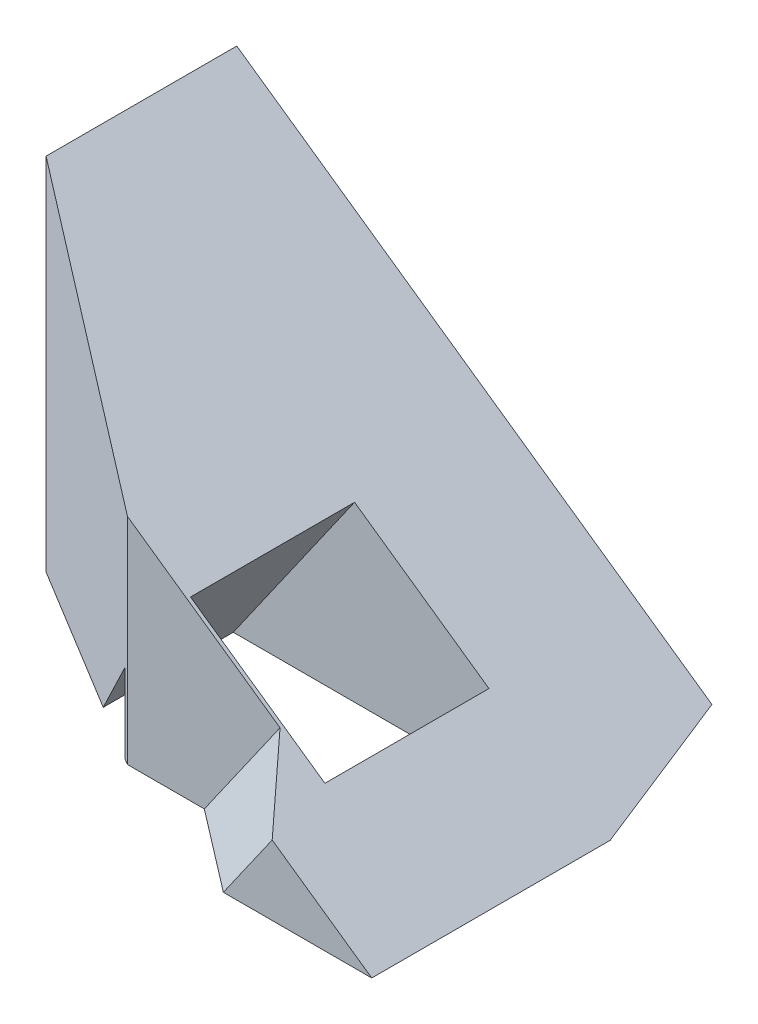
ISO-10303-21;
HEADER;
FILE_DESCRIPTION(('STEP AP214'),'2;1');
FILE_NAME('part.step','',(''),(''),'','','');
FILE_SCHEMA(('AUTOMOTIVE_DESIGN { 1 0 10303 214 1 1 1 1 }'));
ENDSEC;
DATA;
#1=APPLICATION_CONTEXT('core data for automotive mechanical design processes');
#2=APPLICATION_PROTOCOL_DEFINITION('international standard','automotive_design',2000,#1);
#3=PRODUCT_CONTEXT('',#1,'mechanical');
#4=PRODUCT('Part','Part','',(#3));
#5=PRODUCT_RELATED_PRODUCT_CATEGORY('part','',(#4));
#6=PRODUCT_DEFINITION_FORMATION('','',#4);
#7=PRODUCT_DEFINITION_CONTEXT('part definition',#1,'design');
#8=PRODUCT_DEFINITION('design','',#6,#7);
#9=PRODUCT_DEFINITION_SHAPE('','',#8);
#10=(LENGTH_UNIT() NAMED_UNIT(*) SI_UNIT(.MILLI.,.METRE.));
#11=(NAMED_UNIT(*) PLANE_ANGLE_UNIT() SI_UNIT($,.RADIAN.));
#12=(NAMED_UNIT(*) SI_UNIT($,.STERADIAN.) SOLID_ANGLE_UNIT());
#13=UNCERTAINTY_MEASURE_WITH_UNIT(LENGTH_MEASURE(1.E-05),#10,'distance_accuracy_value','');
#14=(GEOMETRIC_REPRESENTATION_CONTEXT(3) GLOBAL_UNCERTAINTY_ASSIGNED_CONTEXT((#13)) GLOBAL_UNIT_ASSIGNED_CONTEXT((#10,
#11,#12)) REPRESENTATION_CONTEXT('',''));
#15=CARTESIAN_POINT('',(0.,0.,0.));
#16=DIRECTION('',(0.,0.,1.));
#17=DIRECTION('',(1.,0.,0.));
#18=AXIS2_PLACEMENT_3D('',#15,#16,#17);
#19=CARTESIAN_POINT('',(0.,0.,0.));
#20=DIRECTION('',(0.,-1.,0.));
#21=DIRECTION('',(0.,0.,-1.));
#22=AXIS2_PLACEMENT_3D('',#19,#20,#21);
#23=PLANE('',#22);
#24=DIRECTION('',(-1.,0.,0.));
#25=VECTOR('',#24,1.);
#26=CARTESIAN_POINT('',(0.,0.,-42.446196436293));
#27=LINE('',#26,#25);
#28=CARTESIAN_POINT('',(83.1695964602295,0.,-42.446196436293));
#29=VERTEX_POINT('',#28);
#30=CARTESIAN_POINT('',(77.5443267417553,0.,-42.446196436293));
#31=VERTEX_POINT('',#30);
#32=EDGE_CURVE('E143',#29,#31,#27,.T.);
#33=ORIENTED_EDGE('',*,*,#32,.T.);
#34=DIRECTION('',(-0.854581285290634,0.,-0.519317655034957));
#35=VECTOR('',#34,1.);
#36=CARTESIAN_POINT('',(62.3754676428153,0.,-51.6641099015267));
#37=LINE('',#36,#35);
#38=CARTESIAN_POINT('',(77.1329305197103,0.,-42.696196436293));
#39=VERTEX_POINT('',#38);
#40=EDGE_CURVE('E128',#31,#39,#37,.T.);
#41=ORIENTED_EDGE('',*,*,#40,.T.);
#42=DIRECTION('',(-1.,0.,0.));
#43=VECTOR('',#42,1.);
#44=CARTESIAN_POINT('',(0.,0.,-42.696196436293));
#45=LINE('',#44,#43);
#46=CARTESIAN_POINT('',(87.6864624386468,0.,-42.696196436293));
#47=VERTEX_POINT('',#46);
#48=EDGE_CURVE('E185',#47,#39,#45,.T.);
#49=ORIENTED_EDGE('',*,*,#48,.F.);
#50=DIRECTION('',(0.,0.,1.));
#51=VECTOR('',#50,1.);
#52=CARTESIAN_POINT('',(87.6864624386468,0.,0.));
#53=LINE('',#52,#51);
#54=CARTESIAN_POINT('',(87.6864624386468,0.,-54.696196436293));
#55=VERTEX_POINT('',#54);
#56=EDGE_CURVE('E191',#55,#47,#53,.T.);
#57=ORIENTED_EDGE('',*,*,#56,.F.);
#58=DIRECTION('',(1.,0.,0.));
#59=VECTOR('',#58,1.);
#60=CARTESIAN_POINT('',(0.,0.,-54.696196436293));
#61=LINE('',#60,#59);
#62=CARTESIAN_POINT('',(73.0371673735094,0.,-54.696196436293));
#63=VERTEX_POINT('',#62);
#64=EDGE_CURVE('E193',#63,#55,#61,.T.);
#65=ORIENTED_EDGE('',*,*,#64,.F.);
#66=DIRECTION('',(0.,0.,-1.));
#67=VECTOR('',#66,1.);
#68=CARTESIAN_POINT('',(73.0371673735094,0.,0.));
#69=LINE('',#68,#67);
#70=CARTESIAN_POINT('',(73.0371673735094,0.,-45.1851371014753));
#71=VERTEX_POINT('',#70);
#72=EDGE_CURVE('E195',#71,#63,#69,.T.);
#73=ORIENTED_EDGE('',*,*,#72,.F.);
#74=CARTESIAN_POINT('',(62.3754676428153,0.,-51.6641099015267));
#75=VERTEX_POINT('',#74);
#76=EDGE_CURVE('E139',#71,#75,#37,.T.);
#77=ORIENTED_EDGE('',*,*,#76,.T.);
#78=DIRECTION('',(0.,0.,-1.));
#79=VECTOR('',#78,1.);
#80=CARTESIAN_POINT('',(62.3754676428153,0.,-99.8905370971883));
#81=LINE('',#80,#79);
#82=CARTESIAN_POINT('',(62.3754676428153,0.,-65.6148234256193));
#83=VERTEX_POINT('',#82);
#84=EDGE_CURVE('E138',#75,#83,#81,.T.);
#85=ORIENTED_EDGE('',*,*,#84,.T.);
#86=DIRECTION('',(1.,0.,0.));
#87=VECTOR('',#86,1.);
#88=CARTESIAN_POINT('',(0.,0.,-65.6148234256193));
#89=LINE('',#88,#87);
#90=CARTESIAN_POINT('',(95.7185966682437,0.,-65.6148234256193));
#91=VERTEX_POINT('',#90);
#92=EDGE_CURVE('E153',#83,#91,#89,.T.);
#93=ORIENTED_EDGE('',*,*,#92,.T.);
#94=DIRECTION('',(0.383369983891683,0.,0.92359485460395));
#95=VECTOR('',#94,1.);
#96=CARTESIAN_POINT('',(104.883392133507,0.,-43.535478951937));
#97=LINE('',#96,#95);
#98=CARTESIAN_POINT('',(100.,0.,-55.3002911099867));
#99=VERTEX_POINT('',#98);
#100=EDGE_CURVE('E157',#91,#99,#97,.T.);
#101=ORIENTED_EDGE('',*,*,#100,.T.);
#102=DIRECTION('',(0.,0.,-1.));
#103=VECTOR('',#102,1.);
#104=CARTESIAN_POINT('',(100.,0.,0.));
#105=LINE('',#104,#103);
#106=CARTESIAN_POINT('',(100.,0.,-37.8598786092113));
#107=VERTEX_POINT('',#106);
#108=EDGE_CURVE('E46',#107,#99,#105,.T.);
#109=ORIENTED_EDGE('',*,*,#108,.F.);
#110=DIRECTION('',(-1.,0.,0.));
#111=VECTOR('',#110,1.);
#112=CARTESIAN_POINT('',(0.,0.,-37.8598786092113));
#113=LINE('',#112,#111);
#114=CARTESIAN_POINT('',(89.1479769112529,0.,-37.8598786092112));
#115=VERTEX_POINT('',#114);
#116=EDGE_CURVE('E155',#107,#115,#113,.T.);
#117=ORIENTED_EDGE('',*,*,#116,.T.);
#118=DIRECTION('',(-0.79342094671779,0.,-0.608673312466914));
#119=VECTOR('',#118,1.);
#120=CARTESIAN_POINT('',(51.3116563919041,0.,-66.8860325535227));
#121=LINE('',#120,#119);
#122=EDGE_CURVE('E152',#115,#29,#121,.T.);
#123=ORIENTED_EDGE('',*,*,#122,.T.);
#124=EDGE_LOOP('',(#33,#41,#49,#57,#65,#73,#77,#85,#93,#101,#109,#117,#123));
#125=FACE_BOUND('',#124,.T.);
#126=ADVANCED_FACE('F39',(#125),#23,.T.);
#127=CARTESIAN_POINT('',(49.0086749133494,-34.3162436119959,-42.696196436293));
#128=DIRECTION('',(-0.819152044288995,0.573576436351041,0.));
#129=DIRECTION('',(-0.573576436351041,-0.819152044288995,0.));
#130=AXIS2_PLACEMENT_3D('',#127,#128,#129);
#131=PLANE('',#130);
#132=DIRECTION('',(0.541618534743351,0.773511430808311,0.329134363492092));
#133=VECTOR('',#132,1.);
#134=CARTESIAN_POINT('',(52.0553594707429,-29.9651271341823,-57.9355020650059));
#135=LINE('',#134,#133);
#136=CARTESIAN_POINT('',(77.1329305197103,5.84935597333473,-42.696196436293));
#137=VERTEX_POINT('',#136);
#138=EDGE_CURVE('E253',#71,#137,#135,.T.);
#139=ORIENTED_EDGE('',*,*,#138,.F.);
#140=ORIENTED_EDGE('',*,*,#72,.T.);
#141=DIRECTION('',(0.573576436351041,0.819152044288995,0.));
#142=VECTOR('',#141,1.);
#143=CARTESIAN_POINT('',(49.0086749133494,-34.3162436119959,-54.696196436293));
#144=LINE('',#143,#142);
#145=CARTESIAN_POINT('',(81.9076677470654,12.6683874272993,-54.696196436293));
#146=VERTEX_POINT('',#145);
#147=EDGE_CURVE('E183',#63,#146,#144,.T.);
#148=ORIENTED_EDGE('',*,*,#147,.T.);
#149=DIRECTION('',(0.,0.,1.));
#150=VECTOR('',#149,1.);
#151=CARTESIAN_POINT('',(81.9076677470654,12.6683874272993,-42.696196436293));
#152=LINE('',#151,#150);
#153=CARTESIAN_POINT('',(81.9076677470654,12.6683874272993,-42.696196436293));
#154=VERTEX_POINT('',#153);
#155=EDGE_CURVE('E162',#146,#154,#152,.T.);
#156=ORIENTED_EDGE('',*,*,#155,.T.);
#157=DIRECTION('',(0.573576436351041,0.819152044288995,0.));
#158=VECTOR('',#157,1.);
#159=CARTESIAN_POINT('',(49.0086749133494,-34.3162436119959,-42.696196436293));
#160=LINE('',#159,#158);
#161=EDGE_CURVE('E180',#137,#154,#160,.T.);
#162=ORIENTED_EDGE('',*,*,#161,.F.);
#163=EDGE_LOOP('',(#139,#140,#148,#156,#162));
#164=FACE_BOUND('',#163,.T.);
#165=ADVANCED_FACE('F280',(#164),#131,.F.);
#166=CARTESIAN_POINT('',(49.0086749133494,-34.3162436119959,-42.696196436293));
#167=DIRECTION('',(0.,0.,1.));
#168=DIRECTION('',(1.,0.,0.));
#169=AXIS2_PLACEMENT_3D('',#166,#167,#168);
#170=PLANE('',#169);
#171=DIRECTION('',(0.,-1.,0.));
#172=VECTOR('',#171,1.);
#173=CARTESIAN_POINT('',(77.1329305197103,-34.3162436119959,-42.696196436293));
#174=LINE('',#173,#172);
#175=EDGE_CURVE('E134',#137,#39,#174,.T.);
#176=ORIENTED_EDGE('',*,*,#175,.F.);
#177=ORIENTED_EDGE('',*,*,#161,.T.);
#178=DIRECTION('',(0.819152044288995,-0.573576436351041,0.));
#179=VECTOR('',#178,1.);
#180=CARTESIAN_POINT('',(81.9076677470654,12.6683874272993,-42.696196436293));
#181=LINE('',#180,#179);
#182=CARTESIAN_POINT('',(91.7374922785333,5.78547019108683,-42.696196436293));
#183=VERTEX_POINT('',#182);
#184=EDGE_CURVE('E167',#154,#183,#181,.T.);
#185=ORIENTED_EDGE('',*,*,#184,.T.);
#186=DIRECTION('',(0.573576436351041,0.819152044288995,0.));
#187=VECTOR('',#186,1.);
#188=CARTESIAN_POINT('',(58.8384994448173,-41.1991608482084,-42.696196436293));
#189=LINE('',#188,#187);
#190=EDGE_CURVE('E60',#47,#183,#189,.T.);
#191=ORIENTED_EDGE('',*,*,#190,.F.);
#192=ORIENTED_EDGE('',*,*,#48,.T.);
#193=EDGE_LOOP('',(#176,#177,#185,#191,#192));
#194=FACE_BOUND('',#193,.T.);
#195=ADVANCED_FACE('F285',(#194),#170,.F.);
#196=CARTESIAN_POINT('',(44.6453339080393,-31.2609993482983,-42.446196436293));
#197=DIRECTION('',(0.,0.,1.));
#198=DIRECTION('',(1.,0.,0.));
#199=AXIS2_PLACEMENT_3D('',#196,#197,#198);
#200=PLANE('',#199);
#201=DIRECTION('',(0.819152044288995,-0.573576436351041,0.));
#202=VECTOR('',#201,1.);
#203=CARTESIAN_POINT('',(77.5443267417553,15.7236316909969,-42.446196436293));
#204=LINE('',#203,#202);
#205=CARTESIAN_POINT('',(77.5443267417553,15.7236316909969,-42.446196436293));
#206=VERTEX_POINT('',#205);
#207=CARTESIAN_POINT('',(88.7066297146641,7.90770300558568,-42.446196436293));
#208=VERTEX_POINT('',#207);
#209=EDGE_CURVE('E146',#206,#208,#204,.T.);
#210=ORIENTED_EDGE('',*,*,#209,.F.);
#211=DIRECTION('',(0.,-1.,0.));
#212=VECTOR('',#211,1.);
#213=CARTESIAN_POINT('',(77.5443267417553,50.,-42.446196436293));
#214=LINE('',#213,#212);
#215=EDGE_CURVE('E131',#206,#31,#214,.T.);
#216=ORIENTED_EDGE('',*,*,#215,.T.);
#217=ORIENTED_EDGE('',*,*,#32,.F.);
#218=DIRECTION('',(0.573576436351041,0.819152044288995,0.));
#219=VECTOR('',#218,1.);
#220=CARTESIAN_POINT('',(55.807636880948,-39.0769280337095,-42.446196436293));
#221=LINE('',#220,#219);
#222=EDGE_CURVE('E237',#29,#208,#221,.T.);
#223=ORIENTED_EDGE('',*,*,#222,.T.);
#224=EDGE_LOOP('',(#210,#216,#217,#223));
#225=FACE_BOUND('',#224,.T.);
#226=ADVANCED_FACE('F142',(#225),#200,.T.);
#227=CARTESIAN_POINT('',(64.2281424098247,-44.9730294805654,-65.6148234256193));
#228=DIRECTION('',(0.,0.,-1.));
#229=DIRECTION('',(-1.,0.,0.));
#230=AXIS2_PLACEMENT_3D('',#227,#228,#229);
#231=PLANE('',#230);
#232=ORIENTED_EDGE('',*,*,#92,.F.);
#233=DIRECTION('',(0.,1.,0.));
#234=VECTOR('',#233,1.);
#235=CARTESIAN_POINT('',(62.3754676428153,-44.9730294805654,-65.6148234256193));
#236=LINE('',#235,#234);
#237=CARTESIAN_POINT('',(62.3754676428153,26.3449811781156,-65.6148234256193));
#238=VERTEX_POINT('',#237);
#239=EDGE_CURVE('E13',#83,#238,#236,.T.);
#240=ORIENTED_EDGE('',*,*,#239,.T.);
#241=DIRECTION('',(-0.819152044288995,0.573576436351041,0.));
#242=VECTOR('',#241,1.);
#243=CARTESIAN_POINT('',(97.1271352435407,2.01160155872979,-65.6148234256193));
#244=LINE('',#243,#242);
#245=CARTESIAN_POINT('',(97.1271352435407,2.01160155872981,-65.6148234256193));
#246=VERTEX_POINT('',#245);
#247=EDGE_CURVE('E52',#246,#238,#244,.T.);
#248=ORIENTED_EDGE('',*,*,#247,.F.);
#249=DIRECTION('',(0.573576436351041,0.819152044288995,0.));
#250=VECTOR('',#249,1.);
#251=CARTESIAN_POINT('',(64.2281424098247,-44.9730294805654,-65.6148234256193));
#252=LINE('',#251,#250);
#253=EDGE_CURVE('E234',#91,#246,#252,.T.);
#254=ORIENTED_EDGE('',*,*,#253,.F.);
#255=EDGE_LOOP('',(#232,#240,#248,#254));
#256=FACE_BOUND('',#255,.T.);
#257=ADVANCED_FACE('F263',(#256),#231,.T.);
#258=CARTESIAN_POINT('',(0.,70.0207538209701,-100.));
#259=DIRECTION('',(0.573576436351041,0.819152044288995,0.));
#260=DIRECTION('',(-0.819152044288995,0.573576436351041,0.));
#261=AXIS2_PLACEMENT_3D('',#258,#259,#260);
#262=PLANE('',#261);
#263=ORIENTED_EDGE('',*,*,#155,.F.);
#264=DIRECTION('',(-0.819152044288995,0.573576436351041,0.));
#265=VECTOR('',#264,1.);
#266=CARTESIAN_POINT('',(81.9076677470654,12.6683874272993,-54.696196436293));
#267=LINE('',#266,#265);
#268=CARTESIAN_POINT('',(91.7374922785333,5.78547019108683,-54.696196436293));
#269=VERTEX_POINT('',#268);
#270=EDGE_CURVE('E175',#269,#146,#267,.T.);
#271=ORIENTED_EDGE('',*,*,#270,.F.);
#272=DIRECTION('',(0.,0.,-1.));
#273=VECTOR('',#272,1.);
#274=CARTESIAN_POINT('',(91.7374922785333,5.78547019108683,-42.696196436293));
#275=LINE('',#274,#273);
#276=EDGE_CURVE('E181',#183,#269,#275,.T.);
#277=ORIENTED_EDGE('',*,*,#276,.F.);
#278=ORIENTED_EDGE('',*,*,#184,.F.);
#279=EDGE_LOOP('',(#263,#271,#277,#278));
#280=FACE_BOUND('',#279,.T.);
#281=DIRECTION('',(0.597894798593125,-0.418650445031278,0.683559518030727));
#282=VECTOR('',#281,1.);
#283=CARTESIAN_POINT('',(88.7066297146641,7.90770300558568,-42.446196436293));
#284=LINE('',#283,#282);
#285=CARTESIAN_POINT('',(92.718183209533,5.09878300854696,-37.8598786092113));
#286=VERTEX_POINT('',#285);
#287=EDGE_CURVE('E229',#208,#286,#284,.T.);
#288=ORIENTED_EDGE('',*,*,#287,.T.);
#289=DIRECTION('',(0.819152044288995,-0.573576436351041,0.));
#290=VECTOR('',#289,1.);
#291=CARTESIAN_POINT('',(92.718183209533,5.09878300854696,-37.8598786092113));
#292=LINE('',#291,#290);
#293=EDGE_CURVE('E212',#286,#107,#292,.T.);
#294=ORIENTED_EDGE('',*,*,#293,.T.);
#295=ORIENTED_EDGE('',*,*,#108,.T.);
#296=DIRECTION('',(-0.263699366796137,0.18464428445178,-0.946767728733192));
#297=VECTOR('',#296,1.);
#298=CARTESIAN_POINT('',(100.,0.,-55.3002911099867));
#299=LINE('',#298,#297);
#300=EDGE_CURVE('E208',#99,#246,#299,.T.);
#301=ORIENTED_EDGE('',*,*,#300,.T.);
#302=ORIENTED_EDGE('',*,*,#247,.T.);
#303=DIRECTION('',(0.,0.,1.));
#304=VECTOR('',#303,1.);
#305=CARTESIAN_POINT('',(62.3754676428153,26.3449811781156,-65.6148234256193));
#306=LINE('',#305,#304);
#307=CARTESIAN_POINT('',(62.3754676428153,26.3449811781156,-51.6641099015267));
#308=VERTEX_POINT('',#307);
#309=EDGE_CURVE('E218',#238,#308,#306,.T.);
#310=ORIENTED_EDGE('',*,*,#309,.T.);
#311=DIRECTION('',(0.733319618982665,-0.513475925128728,0.445628556903971));
#312=VECTOR('',#311,1.);
#313=CARTESIAN_POINT('',(62.3754676428153,26.3449811781156,-51.6641099015267));
#314=LINE('',#313,#312);
#315=EDGE_CURVE('E223',#308,#206,#314,.T.);
#316=ORIENTED_EDGE('',*,*,#315,.T.);
#317=ORIENTED_EDGE('',*,*,#209,.T.);
#318=EDGE_LOOP('',(#288,#294,#295,#301,#302,#310,#316,#317));
#319=FACE_BOUND('',#318,.T.);
#320=ADVANCED_FACE('F247',(#280,#319),#262,.T.);
#321=CARTESIAN_POINT('',(49.0086749133494,-34.3162436119959,-54.696196436293));
#322=DIRECTION('',(0.,0.,-1.));
#323=DIRECTION('',(-1.,0.,0.));
#324=AXIS2_PLACEMENT_3D('',#321,#322,#323);
#325=PLANE('',#324);
#326=ORIENTED_EDGE('',*,*,#64,.T.);
#327=DIRECTION('',(0.573576436351041,0.819152044288995,0.));
#328=VECTOR('',#327,1.);
#329=CARTESIAN_POINT('',(58.8384994448173,-41.1991608482084,-54.696196436293));
#330=LINE('',#329,#328);
#331=EDGE_CURVE('E186',#55,#269,#330,.T.);
#332=ORIENTED_EDGE('',*,*,#331,.T.);
#333=ORIENTED_EDGE('',*,*,#270,.T.);
#334=ORIENTED_EDGE('',*,*,#147,.F.);
#335=EDGE_LOOP('',(#326,#332,#333,#334));
#336=FACE_BOUND('',#335,.T.);
#337=ADVANCED_FACE('F293',(#336),#325,.F.);
#338=CARTESIAN_POINT('',(58.8384994448173,-41.1991608482084,-42.696196436293));
#339=DIRECTION('',(0.819152044288995,-0.573576436351041,0.));
#340=DIRECTION('',(0.573576436351041,0.819152044288995,0.));
#341=AXIS2_PLACEMENT_3D('',#338,#339,#340);
#342=PLANE('',#341);
#343=ORIENTED_EDGE('',*,*,#56,.T.);
#344=ORIENTED_EDGE('',*,*,#190,.T.);
#345=ORIENTED_EDGE('',*,*,#276,.T.);
#346=ORIENTED_EDGE('',*,*,#331,.F.);
#347=EDGE_LOOP('',(#343,#344,#345,#346));
#348=FACE_BOUND('',#347,.T.);
#349=ADVANCED_FACE('F300',(#348),#342,.F.);
#350=CARTESIAN_POINT('',(59.819190375817,-41.8858480307483,-37.8598786092113));
#351=DIRECTION('',(0.,0.,1.));
#352=DIRECTION('',(1.,0.,0.));
#353=AXIS2_PLACEMENT_3D('',#350,#351,#352);
#354=PLANE('',#353);
#355=ORIENTED_EDGE('',*,*,#293,.F.);
#356=DIRECTION('',(0.573576436351041,0.819152044288995,0.));
#357=VECTOR('',#356,1.);
#358=CARTESIAN_POINT('',(59.819190375817,-41.8858480307483,-37.8598786092113));
#359=LINE('',#358,#357);
#360=EDGE_CURVE('E235',#115,#286,#359,.T.);
#361=ORIENTED_EDGE('',*,*,#360,.F.);
#362=ORIENTED_EDGE('',*,*,#116,.F.);
#363=EDGE_LOOP('',(#355,#361,#362));
#364=FACE_BOUND('',#363,.T.);
#365=ADVANCED_FACE('F274',(#364),#354,.T.);
#366=CARTESIAN_POINT('',(55.807636880948,-39.0769280337095,-42.446196436293));
#367=DIRECTION('',(-0.55993917658807,0.3920736323859,0.729894776875133));
#368=DIRECTION('',(0.79342094671779,0.,0.608673312466914));
#369=AXIS2_PLACEMENT_3D('',#366,#367,#368);
#370=PLANE('',#369);
#371=ORIENTED_EDGE('',*,*,#360,.T.);
#372=ORIENTED_EDGE('',*,*,#287,.F.);
#373=ORIENTED_EDGE('',*,*,#222,.F.);
#374=ORIENTED_EDGE('',*,*,#122,.F.);
#375=EDGE_LOOP('',(#371,#372,#373,#374));
#376=FACE_BOUND('',#375,.T.);
#377=ADVANCED_FACE('F266',(#376),#370,.T.);
#378=CARTESIAN_POINT('',(67.101007166284,-46.9846310392952,-55.3002911099867));
#379=DIRECTION('',(0.775546720458643,-0.543043659898953,-0.32191748605721));
#380=DIRECTION('',(0.573576436351041,0.819152044288995,0.));
#381=AXIS2_PLACEMENT_3D('',#378,#379,#380);
#382=PLANE('',#381);
#383=ORIENTED_EDGE('',*,*,#253,.T.);
#384=ORIENTED_EDGE('',*,*,#300,.F.);
#385=ORIENTED_EDGE('',*,*,#100,.F.);
#386=EDGE_LOOP('',(#383,#384,#385));
#387=FACE_BOUND('',#386,.T.);
#388=ADVANCED_FACE('F264',(#387),#382,.T.);
#389=CARTESIAN_POINT('',(62.3754676428153,50.,-51.6641099015267));
#390=DIRECTION('',(-0.519317655034957,0.,0.854581285290634));
#391=DIRECTION('',(0.854581285290635,0.,0.519317655034958));
#392=AXIS2_PLACEMENT_3D('',#389,#390,#391);
#393=PLANE('',#392);
#394=ORIENTED_EDGE('',*,*,#138,.T.);
#395=ORIENTED_EDGE('',*,*,#175,.T.);
#396=ORIENTED_EDGE('',*,*,#40,.F.);
#397=ORIENTED_EDGE('',*,*,#215,.F.);
#398=ORIENTED_EDGE('',*,*,#315,.F.);
#399=DIRECTION('',(0.,-1.,0.));
#400=VECTOR('',#399,1.);
#401=CARTESIAN_POINT('',(62.3754676428153,50.,-51.6641099015267));
#402=LINE('',#401,#400);
#403=EDGE_CURVE('E148',#308,#75,#402,.T.);
#404=ORIENTED_EDGE('',*,*,#403,.T.);
#405=ORIENTED_EDGE('',*,*,#76,.F.);
#406=EDGE_LOOP('',(#394,#395,#396,#397,#398,#404,#405));
#407=FACE_BOUND('',#406,.T.);
#408=ADVANCED_FACE('F130',(#407),#393,.T.);
#409=CARTESIAN_POINT('',(62.3754676428153,50.,-99.8905370971883));
#410=DIRECTION('',(-1.,0.,0.));
#411=DIRECTION('',(0.,0.,1.));
#412=AXIS2_PLACEMENT_3D('',#409,#410,#411);
#413=PLANE('',#412);
#414=ORIENTED_EDGE('',*,*,#239,.F.);
#415=ORIENTED_EDGE('',*,*,#84,.F.);
#416=ORIENTED_EDGE('',*,*,#403,.F.);
#417=ORIENTED_EDGE('',*,*,#309,.F.);
#418=EDGE_LOOP('',(#414,#415,#416,#417));
#419=FACE_BOUND('',#418,.T.);
#420=ADVANCED_FACE('F272',(#419),#413,.T.);
#421=CLOSED_SHELL('',(#126,#165,#195,#226,#257,#320,#337,#349,#365,#377,#388,#408,#420));
#422=MANIFOLD_SOLID_BREP('B2',#421);
#423=ADVANCED_BREP_SHAPE_REPRESENTATION('',(#18,#422),#14);
#424=SHAPE_DEFINITION_REPRESENTATION(#9,#423);
ENDSEC;
END-ISO-10303-21;
